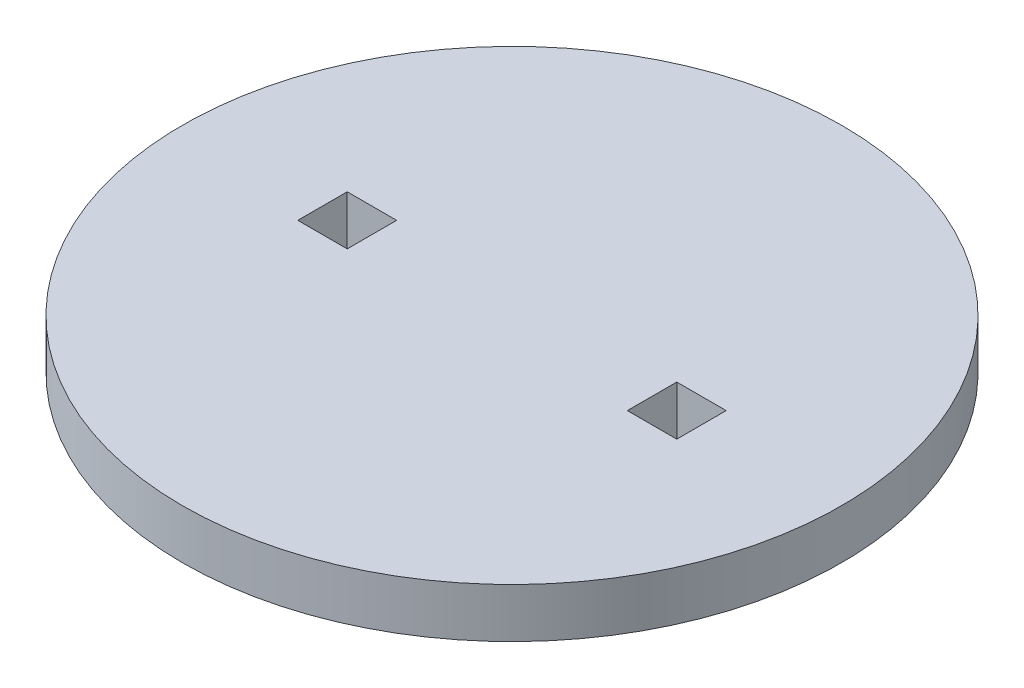
ISO-10303-21;
HEADER;
FILE_DESCRIPTION(('STEP AP214'),'2;1');
FILE_NAME('part.step','',(''),(''),'','','');
FILE_SCHEMA(('AUTOMOTIVE_DESIGN { 1 0 10303 214 1 1 1 1 }'));
ENDSEC;
DATA;
#1=APPLICATION_CONTEXT('core data for automotive mechanical design processes');
#2=APPLICATION_PROTOCOL_DEFINITION('international standard','automotive_design',2000,#1);
#3=PRODUCT_CONTEXT('',#1,'mechanical');
#4=PRODUCT('Part','Part','',(#3));
#5=PRODUCT_RELATED_PRODUCT_CATEGORY('part','',(#4));
#6=PRODUCT_DEFINITION_FORMATION('','',#4);
#7=PRODUCT_DEFINITION_CONTEXT('part definition',#1,'design');
#8=PRODUCT_DEFINITION('design','',#6,#7);
#9=PRODUCT_DEFINITION_SHAPE('','',#8);
#10=(LENGTH_UNIT() NAMED_UNIT(*) SI_UNIT(.MILLI.,.METRE.));
#11=(NAMED_UNIT(*) PLANE_ANGLE_UNIT() SI_UNIT($,.RADIAN.));
#12=(NAMED_UNIT(*) SI_UNIT($,.STERADIAN.) SOLID_ANGLE_UNIT());
#13=UNCERTAINTY_MEASURE_WITH_UNIT(LENGTH_MEASURE(1.E-05),#10,'distance_accuracy_value','');
#14=(GEOMETRIC_REPRESENTATION_CONTEXT(3) GLOBAL_UNCERTAINTY_ASSIGNED_CONTEXT((#13)) GLOBAL_UNIT_ASSIGNED_CONTEXT((#10,
#11,#12)) REPRESENTATION_CONTEXT('',''));
#15=CARTESIAN_POINT('',(0.,0.,0.));
#16=DIRECTION('',(0.,0.,1.));
#17=DIRECTION('',(1.,0.,0.));
#18=AXIS2_PLACEMENT_3D('',#15,#16,#17);
#19=CARTESIAN_POINT('',(0.,6.,0.));
#20=DIRECTION('',(0.,1.,0.));
#21=DIRECTION('',(0.,0.,1.));
#22=AXIS2_PLACEMENT_3D('',#19,#20,#21);
#23=PLANE('',#22);
#24=CARTESIAN_POINT('',(0.,6.,0.));
#25=DIRECTION('',(0.,1.,0.));
#26=DIRECTION('',(0.,0.,1.));
#27=AXIS2_PLACEMENT_3D('',#24,#25,#26);
#28=CIRCLE('',#27,40.);
#29=CARTESIAN_POINT('',(0.,6.,40.));
#30=VERTEX_POINT('',#29);
#31=EDGE_CURVE('E11',#30,#30,#28,.T.);
#32=ORIENTED_EDGE('',*,*,#31,.T.);
#33=EDGE_LOOP('',(#32));
#34=FACE_BOUND('',#33,.T.);
#35=DIRECTION('',(-1.,0.,0.));
#36=VECTOR('',#35,1.);
#37=CARTESIAN_POINT('',(-23.,6.,-3.));
#38=LINE('',#37,#36);
#39=CARTESIAN_POINT('',(-17.,6.,-3.));
#40=VERTEX_POINT('',#39);
#41=CARTESIAN_POINT('',(-23.,6.,-3.));
#42=VERTEX_POINT('',#41);
#43=EDGE_CURVE('E138',#40,#42,#38,.T.);
#44=ORIENTED_EDGE('',*,*,#43,.F.);
#45=DIRECTION('',(0.,0.,-1.));
#46=VECTOR('',#45,1.);
#47=CARTESIAN_POINT('',(-17.,6.,-3.));
#48=LINE('',#47,#46);
#49=CARTESIAN_POINT('',(-17.,6.,3.));
#50=VERTEX_POINT('',#49);
#51=EDGE_CURVE('E136',#50,#40,#48,.T.);
#52=ORIENTED_EDGE('',*,*,#51,.F.);
#53=DIRECTION('',(1.,0.,0.));
#54=VECTOR('',#53,1.);
#55=CARTESIAN_POINT('',(-23.,6.,3.));
#56=LINE('',#55,#54);
#57=CARTESIAN_POINT('',(-23.,6.,3.));
#58=VERTEX_POINT('',#57);
#59=EDGE_CURVE('E144',#58,#50,#56,.T.);
#60=ORIENTED_EDGE('',*,*,#59,.F.);
#61=DIRECTION('',(0.,0.,1.));
#62=VECTOR('',#61,1.);
#63=CARTESIAN_POINT('',(-23.,6.,-3.));
#64=LINE('',#63,#62);
#65=EDGE_CURVE('E141',#42,#58,#64,.T.);
#66=ORIENTED_EDGE('',*,*,#65,.F.);
#67=EDGE_LOOP('',(#44,#52,#60,#66));
#68=FACE_BOUND('',#67,.T.);
#69=DIRECTION('',(-1.,0.,0.));
#70=VECTOR('',#69,1.);
#71=CARTESIAN_POINT('',(23.,6.,-3.));
#72=LINE('',#71,#70);
#73=CARTESIAN_POINT('',(23.,6.,-3.));
#74=VERTEX_POINT('',#73);
#75=CARTESIAN_POINT('',(17.,6.,-3.));
#76=VERTEX_POINT('',#75);
#77=EDGE_CURVE('E108',#74,#76,#72,.T.);
#78=ORIENTED_EDGE('',*,*,#77,.F.);
#79=DIRECTION('',(0.,0.,-1.));
#80=VECTOR('',#79,1.);
#81=CARTESIAN_POINT('',(23.,6.,-3.));
#82=LINE('',#81,#80);
#83=CARTESIAN_POINT('',(23.,6.,3.));
#84=VERTEX_POINT('',#83);
#85=EDGE_CURVE('E100',#84,#74,#82,.T.);
#86=ORIENTED_EDGE('',*,*,#85,.F.);
#87=DIRECTION('',(1.,0.,0.));
#88=VECTOR('',#87,1.);
#89=CARTESIAN_POINT('',(23.,6.,3.));
#90=LINE('',#89,#88);
#91=CARTESIAN_POINT('',(17.,6.,3.));
#92=VERTEX_POINT('',#91);
#93=EDGE_CURVE('E122',#92,#84,#90,.T.);
#94=ORIENTED_EDGE('',*,*,#93,.F.);
#95=DIRECTION('',(0.,0.,1.));
#96=VECTOR('',#95,1.);
#97=CARTESIAN_POINT('',(17.,6.,-3.));
#98=LINE('',#97,#96);
#99=EDGE_CURVE('E120',#76,#92,#98,.T.);
#100=ORIENTED_EDGE('',*,*,#99,.F.);
#101=EDGE_LOOP('',(#78,#86,#94,#100));
#102=FACE_BOUND('',#101,.T.);
#103=ADVANCED_FACE('F35',(#34,#68,#102),#23,.T.);
#104=CARTESIAN_POINT('',(0.,0.,0.));
#105=DIRECTION('',(0.,1.,0.));
#106=DIRECTION('',(0.,0.,1.));
#107=AXIS2_PLACEMENT_3D('',#104,#105,#106);
#108=PLANE('',#107);
#109=DIRECTION('',(0.,0.,-1.));
#110=VECTOR('',#109,1.);
#111=CARTESIAN_POINT('',(-17.,0.,-3.));
#112=LINE('',#111,#110);
#113=CARTESIAN_POINT('',(-17.,0.,3.));
#114=VERTEX_POINT('',#113);
#115=CARTESIAN_POINT('',(-17.,0.,-3.));
#116=VERTEX_POINT('',#115);
#117=EDGE_CURVE('E116',#114,#116,#112,.T.);
#118=ORIENTED_EDGE('',*,*,#117,.T.);
#119=DIRECTION('',(-1.,0.,0.));
#120=VECTOR('',#119,1.);
#121=CARTESIAN_POINT('',(-23.,0.,-3.));
#122=LINE('',#121,#120);
#123=CARTESIAN_POINT('',(-23.,0.,-3.));
#124=VERTEX_POINT('',#123);
#125=EDGE_CURVE('E149',#116,#124,#122,.T.);
#126=ORIENTED_EDGE('',*,*,#125,.T.);
#127=DIRECTION('',(0.,0.,1.));
#128=VECTOR('',#127,1.);
#129=CARTESIAN_POINT('',(-23.,0.,-3.));
#130=LINE('',#129,#128);
#131=CARTESIAN_POINT('',(-23.,0.,3.));
#132=VERTEX_POINT('',#131);
#133=EDGE_CURVE('E152',#124,#132,#130,.T.);
#134=ORIENTED_EDGE('',*,*,#133,.T.);
#135=DIRECTION('',(1.,0.,0.));
#136=VECTOR('',#135,1.);
#137=CARTESIAN_POINT('',(-23.,0.,3.));
#138=LINE('',#137,#136);
#139=EDGE_CURVE('E139',#132,#114,#138,.T.);
#140=ORIENTED_EDGE('',*,*,#139,.T.);
#141=EDGE_LOOP('',(#118,#126,#134,#140));
#142=FACE_BOUND('',#141,.T.);
#143=CARTESIAN_POINT('',(0.,0.,0.));
#144=DIRECTION('',(0.,1.,0.));
#145=DIRECTION('',(0.,0.,1.));
#146=AXIS2_PLACEMENT_3D('',#143,#144,#145);
#147=CIRCLE('',#146,40.);
#148=CARTESIAN_POINT('',(0.,0.,40.));
#149=VERTEX_POINT('',#148);
#150=EDGE_CURVE('E39',#149,#149,#147,.T.);
#151=ORIENTED_EDGE('',*,*,#150,.F.);
#152=EDGE_LOOP('',(#151));
#153=FACE_BOUND('',#152,.T.);
#154=DIRECTION('',(0.,0.,-1.));
#155=VECTOR('',#154,1.);
#156=CARTESIAN_POINT('',(23.,0.,-3.));
#157=LINE('',#156,#155);
#158=CARTESIAN_POINT('',(23.,0.,3.));
#159=VERTEX_POINT('',#158);
#160=CARTESIAN_POINT('',(23.,0.,-3.));
#161=VERTEX_POINT('',#160);
#162=EDGE_CURVE('E58',#159,#161,#157,.T.);
#163=ORIENTED_EDGE('',*,*,#162,.T.);
#164=DIRECTION('',(-1.,0.,0.));
#165=VECTOR('',#164,1.);
#166=CARTESIAN_POINT('',(23.,0.,-3.));
#167=LINE('',#166,#165);
#168=CARTESIAN_POINT('',(17.,0.,-3.));
#169=VERTEX_POINT('',#168);
#170=EDGE_CURVE('E115',#161,#169,#167,.T.);
#171=ORIENTED_EDGE('',*,*,#170,.T.);
#172=DIRECTION('',(0.,0.,1.));
#173=VECTOR('',#172,1.);
#174=CARTESIAN_POINT('',(17.,0.,-3.));
#175=LINE('',#174,#173);
#176=CARTESIAN_POINT('',(17.,0.,3.));
#177=VERTEX_POINT('',#176);
#178=EDGE_CURVE('E128',#169,#177,#175,.T.);
#179=ORIENTED_EDGE('',*,*,#178,.T.);
#180=DIRECTION('',(1.,0.,0.));
#181=VECTOR('',#180,1.);
#182=CARTESIAN_POINT('',(23.,0.,3.));
#183=LINE('',#182,#181);
#184=EDGE_CURVE('E109',#177,#159,#183,.T.);
#185=ORIENTED_EDGE('',*,*,#184,.T.);
#186=EDGE_LOOP('',(#163,#171,#179,#185));
#187=FACE_BOUND('',#186,.T.);
#188=ADVANCED_FACE('F171',(#142,#153,#187),#108,.F.);
#189=CARTESIAN_POINT('',(0.,6.,0.));
#190=DIRECTION('',(0.,-1.,0.));
#191=DIRECTION('',(0.,0.,-1.));
#192=AXIS2_PLACEMENT_3D('',#189,#190,#191);
#193=CYLINDRICAL_SURFACE('',#192,40.);
#194=ORIENTED_EDGE('',*,*,#31,.F.);
#195=EDGE_LOOP('',(#194));
#196=FACE_BOUND('',#195,.T.);
#197=ORIENTED_EDGE('',*,*,#150,.T.);
#198=EDGE_LOOP('',(#197));
#199=FACE_BOUND('',#198,.T.);
#200=ADVANCED_FACE('F37',(#196,#199),#193,.T.);
#201=CARTESIAN_POINT('',(-17.,6.,-3.));
#202=DIRECTION('',(-1.,0.,0.));
#203=DIRECTION('',(0.,0.,1.));
#204=AXIS2_PLACEMENT_3D('',#201,#202,#203);
#205=PLANE('',#204);
#206=ORIENTED_EDGE('',*,*,#117,.F.);
#207=DIRECTION('',(0.,-1.,0.));
#208=VECTOR('',#207,1.);
#209=CARTESIAN_POINT('',(-17.,6.,3.));
#210=LINE('',#209,#208);
#211=EDGE_CURVE('E146',#50,#114,#210,.T.);
#212=ORIENTED_EDGE('',*,*,#211,.F.);
#213=ORIENTED_EDGE('',*,*,#51,.T.);
#214=DIRECTION('',(0.,-1.,0.));
#215=VECTOR('',#214,1.);
#216=CARTESIAN_POINT('',(-17.,6.,-3.));
#217=LINE('',#216,#215);
#218=EDGE_CURVE('E163',#40,#116,#217,.T.);
#219=ORIENTED_EDGE('',*,*,#218,.T.);
#220=EDGE_LOOP('',(#206,#212,#213,#219));
#221=FACE_BOUND('',#220,.T.);
#222=ADVANCED_FACE('F192',(#221),#205,.T.);
#223=CARTESIAN_POINT('',(-23.,6.,-3.));
#224=DIRECTION('',(0.,0.,1.));
#225=DIRECTION('',(1.,0.,0.));
#226=AXIS2_PLACEMENT_3D('',#223,#224,#225);
#227=PLANE('',#226);
#228=ORIENTED_EDGE('',*,*,#125,.F.);
#229=ORIENTED_EDGE('',*,*,#218,.F.);
#230=ORIENTED_EDGE('',*,*,#43,.T.);
#231=DIRECTION('',(0.,-1.,0.));
#232=VECTOR('',#231,1.);
#233=CARTESIAN_POINT('',(-23.,6.,-3.));
#234=LINE('',#233,#232);
#235=EDGE_CURVE('E161',#42,#124,#234,.T.);
#236=ORIENTED_EDGE('',*,*,#235,.T.);
#237=EDGE_LOOP('',(#228,#229,#230,#236));
#238=FACE_BOUND('',#237,.T.);
#239=ADVANCED_FACE('F195',(#238),#227,.T.);
#240=CARTESIAN_POINT('',(-23.,6.,-3.));
#241=DIRECTION('',(1.,0.,0.));
#242=DIRECTION('',(0.,0.,-1.));
#243=AXIS2_PLACEMENT_3D('',#240,#241,#242);
#244=PLANE('',#243);
#245=ORIENTED_EDGE('',*,*,#133,.F.);
#246=ORIENTED_EDGE('',*,*,#235,.F.);
#247=ORIENTED_EDGE('',*,*,#65,.T.);
#248=DIRECTION('',(0.,-1.,0.));
#249=VECTOR('',#248,1.);
#250=CARTESIAN_POINT('',(-23.,6.,3.));
#251=LINE('',#250,#249);
#252=EDGE_CURVE('E159',#58,#132,#251,.T.);
#253=ORIENTED_EDGE('',*,*,#252,.T.);
#254=EDGE_LOOP('',(#245,#246,#247,#253));
#255=FACE_BOUND('',#254,.T.);
#256=ADVANCED_FACE('F198',(#255),#244,.T.);
#257=CARTESIAN_POINT('',(-23.,6.,3.));
#258=DIRECTION('',(0.,0.,-1.));
#259=DIRECTION('',(-1.,0.,0.));
#260=AXIS2_PLACEMENT_3D('',#257,#258,#259);
#261=PLANE('',#260);
#262=ORIENTED_EDGE('',*,*,#139,.F.);
#263=ORIENTED_EDGE('',*,*,#252,.F.);
#264=ORIENTED_EDGE('',*,*,#59,.T.);
#265=ORIENTED_EDGE('',*,*,#211,.T.);
#266=EDGE_LOOP('',(#262,#263,#264,#265));
#267=FACE_BOUND('',#266,.T.);
#268=ADVANCED_FACE('F202',(#267),#261,.T.);
#269=CARTESIAN_POINT('',(23.,6.,-3.));
#270=DIRECTION('',(-1.,0.,0.));
#271=DIRECTION('',(0.,0.,1.));
#272=AXIS2_PLACEMENT_3D('',#269,#270,#271);
#273=PLANE('',#272);
#274=ORIENTED_EDGE('',*,*,#162,.F.);
#275=DIRECTION('',(0.,-1.,0.));
#276=VECTOR('',#275,1.);
#277=CARTESIAN_POINT('',(23.,6.,3.));
#278=LINE('',#277,#276);
#279=EDGE_CURVE('E104',#84,#159,#278,.T.);
#280=ORIENTED_EDGE('',*,*,#279,.F.);
#281=ORIENTED_EDGE('',*,*,#85,.T.);
#282=DIRECTION('',(0.,-1.,0.));
#283=VECTOR('',#282,1.);
#284=CARTESIAN_POINT('',(23.,6.,-3.));
#285=LINE('',#284,#283);
#286=EDGE_CURVE('E103',#74,#161,#285,.T.);
#287=ORIENTED_EDGE('',*,*,#286,.T.);
#288=EDGE_LOOP('',(#274,#280,#281,#287));
#289=FACE_BOUND('',#288,.T.);
#290=ADVANCED_FACE('F102',(#289),#273,.T.);
#291=CARTESIAN_POINT('',(23.,6.,-3.));
#292=DIRECTION('',(0.,0.,1.));
#293=DIRECTION('',(1.,0.,0.));
#294=AXIS2_PLACEMENT_3D('',#291,#292,#293);
#295=PLANE('',#294);
#296=ORIENTED_EDGE('',*,*,#170,.F.);
#297=ORIENTED_EDGE('',*,*,#286,.F.);
#298=ORIENTED_EDGE('',*,*,#77,.T.);
#299=DIRECTION('',(0.,-1.,0.));
#300=VECTOR('',#299,1.);
#301=CARTESIAN_POINT('',(17.,6.,-3.));
#302=LINE('',#301,#300);
#303=EDGE_CURVE('E117',#76,#169,#302,.T.);
#304=ORIENTED_EDGE('',*,*,#303,.T.);
#305=EDGE_LOOP('',(#296,#297,#298,#304));
#306=FACE_BOUND('',#305,.T.);
#307=ADVANCED_FACE('F112',(#306),#295,.T.);
#308=CARTESIAN_POINT('',(17.,6.,-3.));
#309=DIRECTION('',(1.,0.,0.));
#310=DIRECTION('',(0.,0.,-1.));
#311=AXIS2_PLACEMENT_3D('',#308,#309,#310);
#312=PLANE('',#311);
#313=ORIENTED_EDGE('',*,*,#178,.F.);
#314=ORIENTED_EDGE('',*,*,#303,.F.);
#315=ORIENTED_EDGE('',*,*,#99,.T.);
#316=DIRECTION('',(0.,-1.,0.));
#317=VECTOR('',#316,1.);
#318=CARTESIAN_POINT('',(17.,6.,3.));
#319=LINE('',#318,#317);
#320=EDGE_CURVE('E50',#92,#177,#319,.T.);
#321=ORIENTED_EDGE('',*,*,#320,.T.);
#322=EDGE_LOOP('',(#313,#314,#315,#321));
#323=FACE_BOUND('',#322,.T.);
#324=ADVANCED_FACE('F178',(#323),#312,.T.);
#325=CARTESIAN_POINT('',(23.,6.,3.));
#326=DIRECTION('',(0.,0.,-1.));
#327=DIRECTION('',(-1.,0.,0.));
#328=AXIS2_PLACEMENT_3D('',#325,#326,#327);
#329=PLANE('',#328);
#330=ORIENTED_EDGE('',*,*,#184,.F.);
#331=ORIENTED_EDGE('',*,*,#320,.F.);
#332=ORIENTED_EDGE('',*,*,#93,.T.);
#333=ORIENTED_EDGE('',*,*,#279,.T.);
#334=EDGE_LOOP('',(#330,#331,#332,#333));
#335=FACE_BOUND('',#334,.T.);
#336=ADVANCED_FACE('F176',(#335),#329,.T.);
#337=CLOSED_SHELL('',(#103,#188,#200,#222,#239,#256,#268,#290,#307,#324,#336));
#338=MANIFOLD_SOLID_BREP('B2',#337);
#339=ADVANCED_BREP_SHAPE_REPRESENTATION('',(#18,#338),#14);
#340=SHAPE_DEFINITION_REPRESENTATION(#9,#339);
ENDSEC;
END-ISO-10303-21;
